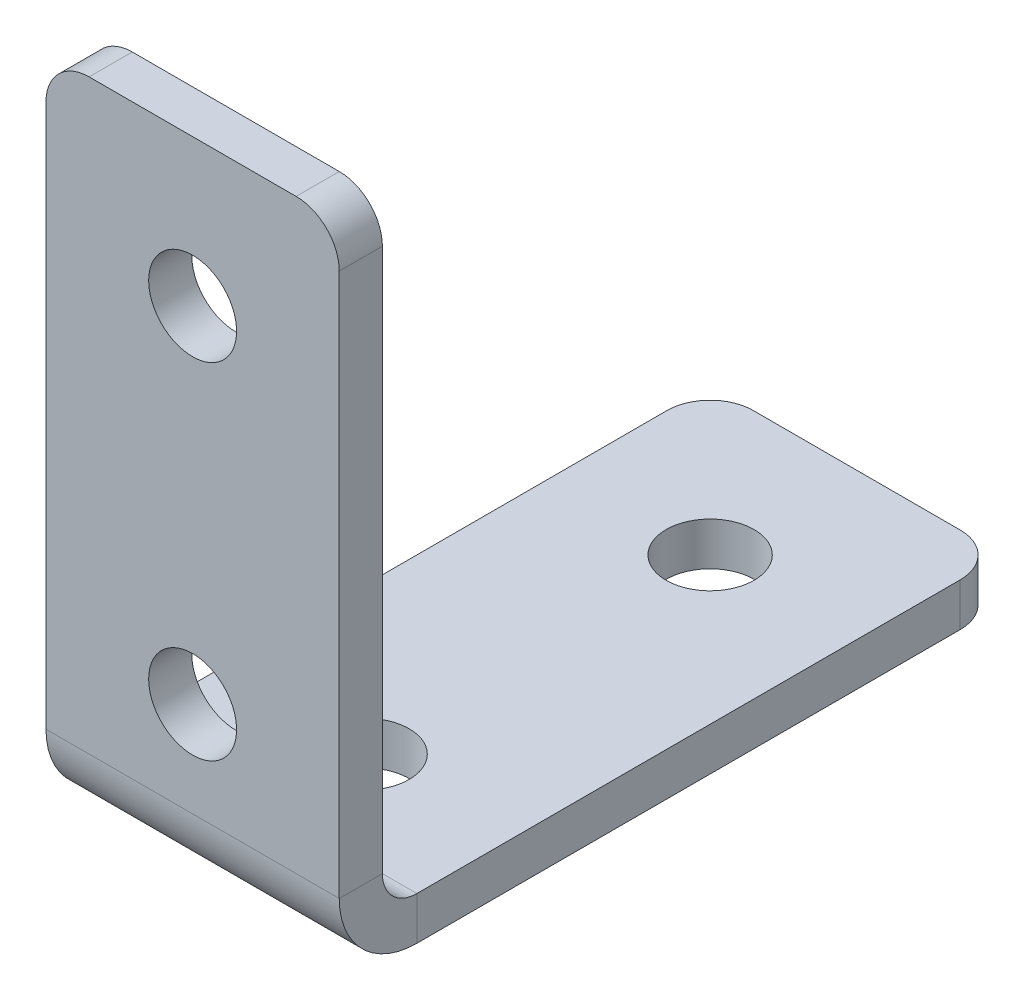
ISO-10303-21;
HEADER;
FILE_DESCRIPTION(('STEP AP214'),'2;1');
FILE_NAME('part.step','',(''),(''),'','','');
FILE_SCHEMA(('AUTOMOTIVE_DESIGN { 1 0 10303 214 1 1 1 1 }'));
ENDSEC;
DATA;
#1=APPLICATION_CONTEXT('core data for automotive mechanical design processes');
#2=APPLICATION_PROTOCOL_DEFINITION('international standard','automotive_design',2000,#1);
#3=PRODUCT_CONTEXT('',#1,'mechanical');
#4=PRODUCT('Part','Part','',(#3));
#5=PRODUCT_RELATED_PRODUCT_CATEGORY('part','',(#4));
#6=PRODUCT_DEFINITION_FORMATION('','',#4);
#7=PRODUCT_DEFINITION_CONTEXT('part definition',#1,'design');
#8=PRODUCT_DEFINITION('design','',#6,#7);
#9=PRODUCT_DEFINITION_SHAPE('','',#8);
#10=(LENGTH_UNIT() NAMED_UNIT(*) SI_UNIT(.MILLI.,.METRE.));
#11=(NAMED_UNIT(*) PLANE_ANGLE_UNIT() SI_UNIT($,.RADIAN.));
#12=(NAMED_UNIT(*) SI_UNIT($,.STERADIAN.) SOLID_ANGLE_UNIT());
#13=UNCERTAINTY_MEASURE_WITH_UNIT(LENGTH_MEASURE(1.E-05),#10,'distance_accuracy_value','');
#14=(GEOMETRIC_REPRESENTATION_CONTEXT(3) GLOBAL_UNCERTAINTY_ASSIGNED_CONTEXT((#13)) GLOBAL_UNIT_ASSIGNED_CONTEXT((#10,
#11,#12)) REPRESENTATION_CONTEXT('',''));
#15=CARTESIAN_POINT('',(0.,0.,0.));
#16=DIRECTION('',(0.,0.,1.));
#17=DIRECTION('',(1.,0.,0.));
#18=AXIS2_PLACEMENT_3D('',#15,#16,#17);
#19=CARTESIAN_POINT('',(14.5,36.,0.));
#20=DIRECTION('',(0.,0.,-1.));
#21=DIRECTION('',(-1.,0.,0.));
#22=AXIS2_PLACEMENT_3D('',#19,#20,#21);
#23=CYLINDRICAL_SURFACE('',#22,2.5);
#24=CARTESIAN_POINT('',(14.5,36.,0.));
#25=DIRECTION('',(0.,0.,-1.));
#26=DIRECTION('',(-1.,0.,0.));
#27=AXIS2_PLACEMENT_3D('',#24,#25,#26);
#28=CIRCLE('',#27,2.5);
#29=CARTESIAN_POINT('',(17.,36.,0.));
#30=VERTEX_POINT('',#29);
#31=CARTESIAN_POINT('',(14.5,38.5,0.));
#32=VERTEX_POINT('',#31);
#33=EDGE_CURVE('E102',#30,#32,#28,.F.);
#34=ORIENTED_EDGE('',*,*,#33,.F.);
#35=DIRECTION('',(0.,0.,-1.));
#36=VECTOR('',#35,1.);
#37=CARTESIAN_POINT('',(17.,36.,-4.5));
#38=LINE('',#37,#36);
#39=CARTESIAN_POINT('',(17.,36.,-2.5));
#40=VERTEX_POINT('',#39);
#41=EDGE_CURVE('E104',#40,#30,#38,.F.);
#42=ORIENTED_EDGE('',*,*,#41,.F.);
#43=CARTESIAN_POINT('',(14.5,36.,-2.5));
#44=DIRECTION('',(0.,0.,-1.));
#45=DIRECTION('',(-1.,0.,0.));
#46=AXIS2_PLACEMENT_3D('',#43,#44,#45);
#47=CIRCLE('',#46,2.5);
#48=CARTESIAN_POINT('',(14.5,38.5,-2.5));
#49=VERTEX_POINT('',#48);
#50=EDGE_CURVE('E119',#49,#40,#47,.T.);
#51=ORIENTED_EDGE('',*,*,#50,.F.);
#52=DIRECTION('',(0.,0.,-1.));
#53=VECTOR('',#52,1.);
#54=CARTESIAN_POINT('',(14.5,38.5,0.));
#55=LINE('',#54,#53);
#56=EDGE_CURVE('E107',#32,#49,#55,.T.);
#57=ORIENTED_EDGE('',*,*,#56,.F.);
#58=EDGE_LOOP('',(#34,#42,#51,#57));
#59=FACE_BOUND('',#58,.T.);
#60=ADVANCED_FACE('F15',(#59),#23,.T.);
#61=CARTESIAN_POINT('',(17.,0.,0.));
#62=DIRECTION('',(0.,0.,-1.));
#63=DIRECTION('',(-1.,0.,0.));
#64=AXIS2_PLACEMENT_3D('',#61,#62,#63);
#65=PLANE('',#64);
#66=CARTESIAN_POINT('',(8.5,30.,0.));
#67=DIRECTION('',(0.,0.,-1.));
#68=DIRECTION('',(-1.,0.,0.));
#69=AXIS2_PLACEMENT_3D('',#66,#67,#68);
#70=CIRCLE('',#69,2.55);
#71=CARTESIAN_POINT('',(5.95,30.,0.));
#72=VERTEX_POINT('',#71);
#73=EDGE_CURVE('E131',#72,#72,#70,.T.);
#74=ORIENTED_EDGE('',*,*,#73,.T.);
#75=EDGE_LOOP('',(#74));
#76=FACE_BOUND('',#75,.T.);
#77=CARTESIAN_POINT('',(8.5,10.,0.));
#78=DIRECTION('',(0.,0.,-1.));
#79=DIRECTION('',(-1.,0.,0.));
#80=AXIS2_PLACEMENT_3D('',#77,#78,#79);
#81=CIRCLE('',#80,2.55);
#82=CARTESIAN_POINT('',(5.95,10.,0.));
#83=VERTEX_POINT('',#82);
#84=EDGE_CURVE('E126',#83,#83,#81,.T.);
#85=ORIENTED_EDGE('',*,*,#84,.T.);
#86=EDGE_LOOP('',(#85));
#87=FACE_BOUND('',#86,.T.);
#88=DIRECTION('',(0.,-1.,0.));
#89=VECTOR('',#88,1.);
#90=CARTESIAN_POINT('',(17.,0.,0.));
#91=LINE('',#90,#89);
#92=CARTESIAN_POINT('',(17.,4.5,0.));
#93=VERTEX_POINT('',#92);
#94=EDGE_CURVE('E116',#30,#93,#91,.T.);
#95=ORIENTED_EDGE('',*,*,#94,.F.);
#96=ORIENTED_EDGE('',*,*,#33,.T.);
#97=DIRECTION('',(-1.,0.,0.));
#98=VECTOR('',#97,1.);
#99=CARTESIAN_POINT('',(17.,38.5,0.));
#100=LINE('',#99,#98);
#101=CARTESIAN_POINT('',(2.5,38.5,0.));
#102=VERTEX_POINT('',#101);
#103=EDGE_CURVE('E125',#32,#102,#100,.T.);
#104=ORIENTED_EDGE('',*,*,#103,.T.);
#105=CARTESIAN_POINT('',(2.5,36.,0.));
#106=DIRECTION('',(0.,0.,-1.));
#107=DIRECTION('',(-1.,0.,0.));
#108=AXIS2_PLACEMENT_3D('',#105,#106,#107);
#109=CIRCLE('',#108,2.5);
#110=CARTESIAN_POINT('',(0.,36.,0.));
#111=VERTEX_POINT('',#110);
#112=EDGE_CURVE('E128',#102,#111,#109,.F.);
#113=ORIENTED_EDGE('',*,*,#112,.T.);
#114=DIRECTION('',(0.,-1.,0.));
#115=VECTOR('',#114,1.);
#116=CARTESIAN_POINT('',(0.,0.,0.));
#117=LINE('',#116,#115);
#118=CARTESIAN_POINT('',(0.,4.5,0.));
#119=VERTEX_POINT('',#118);
#120=EDGE_CURVE('E136',#111,#119,#117,.T.);
#121=ORIENTED_EDGE('',*,*,#120,.T.);
#122=DIRECTION('',(-1.,0.,0.));
#123=VECTOR('',#122,1.);
#124=CARTESIAN_POINT('',(17.,4.5,0.));
#125=LINE('',#124,#123);
#126=EDGE_CURVE('E123',#93,#119,#125,.T.);
#127=ORIENTED_EDGE('',*,*,#126,.F.);
#128=EDGE_LOOP('',(#95,#96,#104,#113,#121,#127));
#129=FACE_BOUND('',#128,.T.);
#130=ADVANCED_FACE('F121',(#76,#87,#129),#65,.F.);
#131=CARTESIAN_POINT('',(8.5,30.,0.));
#132=DIRECTION('',(0.,0.,-1.));
#133=DIRECTION('',(-1.,0.,0.));
#134=AXIS2_PLACEMENT_3D('',#131,#132,#133);
#135=CYLINDRICAL_SURFACE('',#134,2.55);
#136=ORIENTED_EDGE('',*,*,#73,.F.);
#137=EDGE_LOOP('',(#136));
#138=FACE_BOUND('',#137,.T.);
#139=CARTESIAN_POINT('',(8.5,30.,-2.5));
#140=DIRECTION('',(0.,0.,-1.));
#141=DIRECTION('',(-1.,0.,0.));
#142=AXIS2_PLACEMENT_3D('',#139,#140,#141);
#143=CIRCLE('',#142,2.55);
#144=CARTESIAN_POINT('',(5.95,30.,-2.5));
#145=VERTEX_POINT('',#144);
#146=EDGE_CURVE('E139',#145,#145,#143,.T.);
#147=ORIENTED_EDGE('',*,*,#146,.T.);
#148=EDGE_LOOP('',(#147));
#149=FACE_BOUND('',#148,.T.);
#150=ADVANCED_FACE('F305',(#138,#149),#135,.F.);
#151=CARTESIAN_POINT('',(17.,0.,-2.5));
#152=DIRECTION('',(0.,0.,-1.));
#153=DIRECTION('',(-1.,0.,0.));
#154=AXIS2_PLACEMENT_3D('',#151,#152,#153);
#155=PLANE('',#154);
#156=ORIENTED_EDGE('',*,*,#146,.F.);
#157=EDGE_LOOP('',(#156));
#158=FACE_BOUND('',#157,.T.);
#159=CARTESIAN_POINT('',(8.5,10.,-2.5));
#160=DIRECTION('',(0.,0.,-1.));
#161=DIRECTION('',(-1.,0.,0.));
#162=AXIS2_PLACEMENT_3D('',#159,#160,#161);
#163=CIRCLE('',#162,2.55);
#164=CARTESIAN_POINT('',(5.95,10.,-2.5));
#165=VERTEX_POINT('',#164);
#166=EDGE_CURVE('E142',#165,#165,#163,.T.);
#167=ORIENTED_EDGE('',*,*,#166,.F.);
#168=EDGE_LOOP('',(#167));
#169=FACE_BOUND('',#168,.T.);
#170=DIRECTION('',(-1.,0.,0.));
#171=VECTOR('',#170,1.);
#172=CARTESIAN_POINT('',(17.,38.5,-2.5));
#173=LINE('',#172,#171);
#174=CARTESIAN_POINT('',(2.5,38.5,-2.5));
#175=VERTEX_POINT('',#174);
#176=EDGE_CURVE('E145',#49,#175,#173,.T.);
#177=ORIENTED_EDGE('',*,*,#176,.F.);
#178=ORIENTED_EDGE('',*,*,#50,.T.);
#179=DIRECTION('',(0.,1.,0.));
#180=VECTOR('',#179,1.);
#181=CARTESIAN_POINT('',(17.,0.,-2.5));
#182=LINE('',#181,#180);
#183=CARTESIAN_POINT('',(17.,4.5,-2.5));
#184=VERTEX_POINT('',#183);
#185=EDGE_CURVE('E118',#40,#184,#182,.F.);
#186=ORIENTED_EDGE('',*,*,#185,.T.);
#187=DIRECTION('',(-1.,0.,0.));
#188=VECTOR('',#187,1.);
#189=CARTESIAN_POINT('',(17.,4.5,-2.5));
#190=LINE('',#189,#188);
#191=CARTESIAN_POINT('',(0.,4.5,-2.5));
#192=VERTEX_POINT('',#191);
#193=EDGE_CURVE('E148',#184,#192,#190,.T.);
#194=ORIENTED_EDGE('',*,*,#193,.T.);
#195=DIRECTION('',(0.,1.,0.));
#196=VECTOR('',#195,1.);
#197=CARTESIAN_POINT('',(0.,0.,-2.5));
#198=LINE('',#197,#196);
#199=CARTESIAN_POINT('',(0.,36.,-2.5));
#200=VERTEX_POINT('',#199);
#201=EDGE_CURVE('E150',#200,#192,#198,.F.);
#202=ORIENTED_EDGE('',*,*,#201,.F.);
#203=CARTESIAN_POINT('',(2.5,36.,-2.5));
#204=DIRECTION('',(0.,0.,-1.));
#205=DIRECTION('',(-1.,0.,0.));
#206=AXIS2_PLACEMENT_3D('',#203,#204,#205);
#207=CIRCLE('',#206,2.5);
#208=EDGE_CURVE('E153',#200,#175,#207,.T.);
#209=ORIENTED_EDGE('',*,*,#208,.T.);
#210=EDGE_LOOP('',(#177,#178,#186,#194,#202,#209));
#211=FACE_BOUND('',#210,.T.);
#212=ADVANCED_FACE('F291',(#158,#169,#211),#155,.T.);
#213=CARTESIAN_POINT('',(8.5,10.,0.));
#214=DIRECTION('',(0.,0.,-1.));
#215=DIRECTION('',(-1.,0.,0.));
#216=AXIS2_PLACEMENT_3D('',#213,#214,#215);
#217=CYLINDRICAL_SURFACE('',#216,2.55);
#218=ORIENTED_EDGE('',*,*,#84,.F.);
#219=EDGE_LOOP('',(#218));
#220=FACE_BOUND('',#219,.T.);
#221=ORIENTED_EDGE('',*,*,#166,.T.);
#222=EDGE_LOOP('',(#221));
#223=FACE_BOUND('',#222,.T.);
#224=ADVANCED_FACE('F313',(#220,#223),#217,.F.);
#225=CARTESIAN_POINT('',(17.,38.5,0.));
#226=DIRECTION('',(0.,1.,0.));
#227=DIRECTION('',(0.,0.,1.));
#228=AXIS2_PLACEMENT_3D('',#225,#226,#227);
#229=PLANE('',#228);
#230=ORIENTED_EDGE('',*,*,#103,.F.);
#231=ORIENTED_EDGE('',*,*,#56,.T.);
#232=ORIENTED_EDGE('',*,*,#176,.T.);
#233=DIRECTION('',(0.,0.,-1.));
#234=VECTOR('',#233,1.);
#235=CARTESIAN_POINT('',(2.5,38.5,0.));
#236=LINE('',#235,#234);
#237=EDGE_CURVE('E156',#175,#102,#236,.F.);
#238=ORIENTED_EDGE('',*,*,#237,.T.);
#239=EDGE_LOOP('',(#230,#231,#232,#238));
#240=FACE_BOUND('',#239,.T.);
#241=ADVANCED_FACE('F297',(#240),#229,.T.);
#242=CARTESIAN_POINT('',(2.5,36.,-4.5));
#243=DIRECTION('',(0.,0.,1.));
#244=DIRECTION('',(1.,0.,0.));
#245=AXIS2_PLACEMENT_3D('',#242,#243,#244);
#246=CYLINDRICAL_SURFACE('',#245,2.5);
#247=ORIENTED_EDGE('',*,*,#112,.F.);
#248=ORIENTED_EDGE('',*,*,#237,.F.);
#249=ORIENTED_EDGE('',*,*,#208,.F.);
#250=DIRECTION('',(0.,0.,-1.));
#251=VECTOR('',#250,1.);
#252=CARTESIAN_POINT('',(0.,36.,-2.5));
#253=LINE('',#252,#251);
#254=EDGE_CURVE('E159',#111,#200,#253,.T.);
#255=ORIENTED_EDGE('',*,*,#254,.F.);
#256=EDGE_LOOP('',(#247,#248,#249,#255));
#257=FACE_BOUND('',#256,.T.);
#258=ADVANCED_FACE('F295',(#257),#246,.T.);
#259=CARTESIAN_POINT('',(0.,4.5,-4.5));
#260=DIRECTION('',(1.,0.,0.));
#261=DIRECTION('',(0.,0.,-1.));
#262=AXIS2_PLACEMENT_3D('',#259,#260,#261);
#263=PLANE('',#262);
#264=ORIENTED_EDGE('',*,*,#120,.F.);
#265=ORIENTED_EDGE('',*,*,#254,.T.);
#266=ORIENTED_EDGE('',*,*,#201,.T.);
#267=DIRECTION('',(0.,0.,1.));
#268=VECTOR('',#267,1.);
#269=CARTESIAN_POINT('',(0.,4.5,-2.5));
#270=LINE('',#269,#268);
#271=EDGE_CURVE('E162',#192,#119,#270,.T.);
#272=ORIENTED_EDGE('',*,*,#271,.T.);
#273=EDGE_LOOP('',(#264,#265,#266,#272));
#274=FACE_BOUND('',#273,.T.);
#275=ADVANCED_FACE('F286',(#274),#263,.F.);
#276=CARTESIAN_POINT('',(0.,0.,-4.5));
#277=DIRECTION('',(-1.,0.,0.));
#278=DIRECTION('',(0.,0.,1.));
#279=AXIS2_PLACEMENT_3D('',#276,#277,#278);
#280=PLANE('',#279);
#281=DIRECTION('',(0.,1.,0.));
#282=VECTOR('',#281,1.);
#283=CARTESIAN_POINT('',(0.,0.,-4.5));
#284=LINE('',#283,#282);
#285=CARTESIAN_POINT('',(0.,0.,-4.5));
#286=VERTEX_POINT('',#285);
#287=CARTESIAN_POINT('',(0.,2.5,-4.5));
#288=VERTEX_POINT('',#287);
#289=EDGE_CURVE('E165',#286,#288,#284,.T.);
#290=ORIENTED_EDGE('',*,*,#289,.F.);
#291=CARTESIAN_POINT('',(0.,4.5,-4.5));
#292=DIRECTION('',(-1.,0.,0.));
#293=DIRECTION('',(0.,0.,1.));
#294=AXIS2_PLACEMENT_3D('',#291,#292,#293);
#295=CIRCLE('',#294,4.5);
#296=EDGE_CURVE('E167',#119,#286,#295,.F.);
#297=ORIENTED_EDGE('',*,*,#296,.F.);
#298=ORIENTED_EDGE('',*,*,#271,.F.);
#299=CARTESIAN_POINT('',(0.,4.5,-4.5));
#300=DIRECTION('',(1.,0.,0.));
#301=DIRECTION('',(0.,0.,-1.));
#302=AXIS2_PLACEMENT_3D('',#299,#300,#301);
#303=CIRCLE('',#302,2.);
#304=EDGE_CURVE('E170',#192,#288,#303,.T.);
#305=ORIENTED_EDGE('',*,*,#304,.T.);
#306=EDGE_LOOP('',(#290,#297,#298,#305));
#307=FACE_BOUND('',#306,.T.);
#308=ADVANCED_FACE('F283',(#307),#280,.T.);
#309=CARTESIAN_POINT('',(0.,4.5,-2.5));
#310=DIRECTION('',(-1.,0.,0.));
#311=DIRECTION('',(0.,0.,1.));
#312=AXIS2_PLACEMENT_3D('',#309,#310,#311);
#313=PLANE('',#312);
#314=DIRECTION('',(0.,0.,-1.));
#315=VECTOR('',#314,1.);
#316=CARTESIAN_POINT('',(0.,2.5,0.));
#317=LINE('',#316,#315);
#318=CARTESIAN_POINT('',(0.,2.5,-36.));
#319=VERTEX_POINT('',#318);
#320=EDGE_CURVE('E173',#288,#319,#317,.T.);
#321=ORIENTED_EDGE('',*,*,#320,.T.);
#322=DIRECTION('',(0.,-1.,0.));
#323=VECTOR('',#322,1.);
#324=CARTESIAN_POINT('',(0.,4.5,-36.));
#325=LINE('',#324,#323);
#326=CARTESIAN_POINT('',(0.,0.,-36.));
#327=VERTEX_POINT('',#326);
#328=EDGE_CURVE('E175',#319,#327,#325,.T.);
#329=ORIENTED_EDGE('',*,*,#328,.T.);
#330=DIRECTION('',(0.,0.,-1.));
#331=VECTOR('',#330,1.);
#332=CARTESIAN_POINT('',(0.,0.,0.));
#333=LINE('',#332,#331);
#334=EDGE_CURVE('E177',#286,#327,#333,.T.);
#335=ORIENTED_EDGE('',*,*,#334,.F.);
#336=ORIENTED_EDGE('',*,*,#289,.T.);
#337=EDGE_LOOP('',(#321,#329,#335,#336));
#338=FACE_BOUND('',#337,.T.);
#339=ADVANCED_FACE('F257',(#338),#313,.T.);
#340=CARTESIAN_POINT('',(17.,2.5,0.));
#341=DIRECTION('',(0.,1.,0.));
#342=DIRECTION('',(0.,0.,1.));
#343=AXIS2_PLACEMENT_3D('',#340,#341,#342);
#344=PLANE('',#343);
#345=CARTESIAN_POINT('',(8.5,2.5,-30.));
#346=DIRECTION('',(0.,1.,0.));
#347=DIRECTION('',(0.,0.,1.));
#348=AXIS2_PLACEMENT_3D('',#345,#346,#347);
#349=CIRCLE('',#348,2.55);
#350=CARTESIAN_POINT('',(8.5,2.5,-27.45));
#351=VERTEX_POINT('',#350);
#352=EDGE_CURVE('E180',#351,#351,#349,.T.);
#353=ORIENTED_EDGE('',*,*,#352,.F.);
#354=EDGE_LOOP('',(#353));
#355=FACE_BOUND('',#354,.T.);
#356=CARTESIAN_POINT('',(8.5,2.5,-10.));
#357=DIRECTION('',(0.,1.,0.));
#358=DIRECTION('',(0.,0.,1.));
#359=AXIS2_PLACEMENT_3D('',#356,#357,#358);
#360=CIRCLE('',#359,2.55);
#361=CARTESIAN_POINT('',(8.5,2.5,-7.45000000000001));
#362=VERTEX_POINT('',#361);
#363=EDGE_CURVE('E183',#362,#362,#360,.T.);
#364=ORIENTED_EDGE('',*,*,#363,.F.);
#365=EDGE_LOOP('',(#364));
#366=FACE_BOUND('',#365,.T.);
#367=DIRECTION('',(-1.,0.,0.));
#368=VECTOR('',#367,1.);
#369=CARTESIAN_POINT('',(17.,2.5,-38.5));
#370=LINE('',#369,#368);
#371=CARTESIAN_POINT('',(14.5,2.5,-38.5));
#372=VERTEX_POINT('',#371);
#373=CARTESIAN_POINT('',(2.5,2.5,-38.5));
#374=VERTEX_POINT('',#373);
#375=EDGE_CURVE('E186',#372,#374,#370,.T.);
#376=ORIENTED_EDGE('',*,*,#375,.T.);
#377=CARTESIAN_POINT('',(2.5,2.5,-36.));
#378=DIRECTION('',(0.,1.,0.));
#379=DIRECTION('',(0.,0.,1.));
#380=AXIS2_PLACEMENT_3D('',#377,#378,#379);
#381=CIRCLE('',#380,2.5);
#382=EDGE_CURVE('E188',#374,#319,#381,.T.);
#383=ORIENTED_EDGE('',*,*,#382,.T.);
#384=ORIENTED_EDGE('',*,*,#320,.F.);
#385=DIRECTION('',(-1.,0.,0.));
#386=VECTOR('',#385,1.);
#387=CARTESIAN_POINT('',(17.,2.5,-4.5));
#388=LINE('',#387,#386);
#389=CARTESIAN_POINT('',(17.,2.5,-4.5));
#390=VERTEX_POINT('',#389);
#391=EDGE_CURVE('E191',#390,#288,#388,.T.);
#392=ORIENTED_EDGE('',*,*,#391,.F.);
#393=DIRECTION('',(0.,0.,-1.));
#394=VECTOR('',#393,1.);
#395=CARTESIAN_POINT('',(17.,2.5,0.));
#396=LINE('',#395,#394);
#397=CARTESIAN_POINT('',(17.,2.5,-36.));
#398=VERTEX_POINT('',#397);
#399=EDGE_CURVE('E194',#390,#398,#396,.T.);
#400=ORIENTED_EDGE('',*,*,#399,.T.);
#401=CARTESIAN_POINT('',(14.5,2.5,-36.));
#402=DIRECTION('',(0.,1.,0.));
#403=DIRECTION('',(0.,0.,1.));
#404=AXIS2_PLACEMENT_3D('',#401,#402,#403);
#405=CIRCLE('',#404,2.5);
#406=EDGE_CURVE('E196',#398,#372,#405,.T.);
#407=ORIENTED_EDGE('',*,*,#406,.T.);
#408=EDGE_LOOP('',(#376,#383,#384,#392,#400,#407));
#409=FACE_BOUND('',#408,.T.);
#410=ADVANCED_FACE('F243',(#355,#366,#409),#344,.T.);
#411=CARTESIAN_POINT('',(8.5,0.,-30.));
#412=DIRECTION('',(0.,1.,0.));
#413=DIRECTION('',(0.,0.,1.));
#414=AXIS2_PLACEMENT_3D('',#411,#412,#413);
#415=CYLINDRICAL_SURFACE('',#414,2.55);
#416=CARTESIAN_POINT('',(8.5,0.,-30.));
#417=DIRECTION('',(0.,1.,0.));
#418=DIRECTION('',(0.,0.,1.));
#419=AXIS2_PLACEMENT_3D('',#416,#417,#418);
#420=CIRCLE('',#419,2.55);
#421=CARTESIAN_POINT('',(8.5,0.,-27.45));
#422=VERTEX_POINT('',#421);
#423=EDGE_CURVE('E199',#422,#422,#420,.T.);
#424=ORIENTED_EDGE('',*,*,#423,.F.);
#425=EDGE_LOOP('',(#424));
#426=FACE_BOUND('',#425,.T.);
#427=ORIENTED_EDGE('',*,*,#352,.T.);
#428=EDGE_LOOP('',(#427));
#429=FACE_BOUND('',#428,.T.);
#430=ADVANCED_FACE('F261',(#426,#429),#415,.F.);
#431=CARTESIAN_POINT('',(17.,0.,0.));
#432=DIRECTION('',(0.,1.,0.));
#433=DIRECTION('',(0.,0.,1.));
#434=AXIS2_PLACEMENT_3D('',#431,#432,#433);
#435=PLANE('',#434);
#436=ORIENTED_EDGE('',*,*,#423,.T.);
#437=EDGE_LOOP('',(#436));
#438=FACE_BOUND('',#437,.T.);
#439=CARTESIAN_POINT('',(8.5,0.,-10.));
#440=DIRECTION('',(0.,1.,0.));
#441=DIRECTION('',(0.,0.,1.));
#442=AXIS2_PLACEMENT_3D('',#439,#440,#441);
#443=CIRCLE('',#442,2.55);
#444=CARTESIAN_POINT('',(8.5,0.,-7.45000000000001));
#445=VERTEX_POINT('',#444);
#446=EDGE_CURVE('E202',#445,#445,#443,.T.);
#447=ORIENTED_EDGE('',*,*,#446,.T.);
#448=EDGE_LOOP('',(#447));
#449=FACE_BOUND('',#448,.T.);
#450=ORIENTED_EDGE('',*,*,#334,.T.);
#451=CARTESIAN_POINT('',(2.5,0.,-36.));
#452=DIRECTION('',(0.,1.,0.));
#453=DIRECTION('',(0.,0.,1.));
#454=AXIS2_PLACEMENT_3D('',#451,#452,#453);
#455=CIRCLE('',#454,2.5);
#456=CARTESIAN_POINT('',(2.5,0.,-38.5));
#457=VERTEX_POINT('',#456);
#458=EDGE_CURVE('E205',#327,#457,#455,.F.);
#459=ORIENTED_EDGE('',*,*,#458,.T.);
#460=DIRECTION('',(-1.,0.,0.));
#461=VECTOR('',#460,1.);
#462=CARTESIAN_POINT('',(17.,0.,-38.5));
#463=LINE('',#462,#461);
#464=CARTESIAN_POINT('',(14.5,0.,-38.5));
#465=VERTEX_POINT('',#464);
#466=EDGE_CURVE('E207',#465,#457,#463,.T.);
#467=ORIENTED_EDGE('',*,*,#466,.F.);
#468=CARTESIAN_POINT('',(14.5,0.,-36.));
#469=DIRECTION('',(0.,1.,0.));
#470=DIRECTION('',(0.,0.,1.));
#471=AXIS2_PLACEMENT_3D('',#468,#469,#470);
#472=CIRCLE('',#471,2.5);
#473=CARTESIAN_POINT('',(17.,0.,-36.));
#474=VERTEX_POINT('',#473);
#475=EDGE_CURVE('E35',#465,#474,#472,.F.);
#476=ORIENTED_EDGE('',*,*,#475,.T.);
#477=DIRECTION('',(0.,0.,-1.));
#478=VECTOR('',#477,1.);
#479=CARTESIAN_POINT('',(17.,0.,0.));
#480=LINE('',#479,#478);
#481=CARTESIAN_POINT('',(17.,0.,-4.5));
#482=VERTEX_POINT('',#481);
#483=EDGE_CURVE('E30',#482,#474,#480,.T.);
#484=ORIENTED_EDGE('',*,*,#483,.F.);
#485=DIRECTION('',(-1.,0.,0.));
#486=VECTOR('',#485,1.);
#487=CARTESIAN_POINT('',(17.,0.,-4.5));
#488=LINE('',#487,#486);
#489=EDGE_CURVE('E212',#482,#286,#488,.T.);
#490=ORIENTED_EDGE('',*,*,#489,.T.);
#491=EDGE_LOOP('',(#450,#459,#467,#476,#484,#490));
#492=FACE_BOUND('',#491,.T.);
#493=ADVANCED_FACE('F258',(#438,#449,#492),#435,.F.);
#494=CARTESIAN_POINT('',(8.5,0.,-10.));
#495=DIRECTION('',(0.,1.,0.));
#496=DIRECTION('',(0.,0.,1.));
#497=AXIS2_PLACEMENT_3D('',#494,#495,#496);
#498=CYLINDRICAL_SURFACE('',#497,2.55);
#499=ORIENTED_EDGE('',*,*,#446,.F.);
#500=EDGE_LOOP('',(#499));
#501=FACE_BOUND('',#500,.T.);
#502=ORIENTED_EDGE('',*,*,#363,.T.);
#503=EDGE_LOOP('',(#502));
#504=FACE_BOUND('',#503,.T.);
#505=ADVANCED_FACE('F260',(#501,#504),#498,.F.);
#506=CARTESIAN_POINT('',(2.5,4.5,-36.));
#507=DIRECTION('',(0.,-1.,0.));
#508=DIRECTION('',(0.,0.,-1.));
#509=AXIS2_PLACEMENT_3D('',#506,#507,#508);
#510=CYLINDRICAL_SURFACE('',#509,2.5);
#511=ORIENTED_EDGE('',*,*,#382,.F.);
#512=DIRECTION('',(0.,-1.,0.));
#513=VECTOR('',#512,1.);
#514=CARTESIAN_POINT('',(2.5,2.5,-38.5));
#515=LINE('',#514,#513);
#516=EDGE_CURVE('E214',#457,#374,#515,.F.);
#517=ORIENTED_EDGE('',*,*,#516,.F.);
#518=ORIENTED_EDGE('',*,*,#458,.F.);
#519=ORIENTED_EDGE('',*,*,#328,.F.);
#520=EDGE_LOOP('',(#511,#517,#518,#519));
#521=FACE_BOUND('',#520,.T.);
#522=ADVANCED_FACE('F254',(#521),#510,.T.);
#523=CARTESIAN_POINT('',(17.,2.5,-38.5));
#524=DIRECTION('',(0.,0.,-1.));
#525=DIRECTION('',(-1.,0.,0.));
#526=AXIS2_PLACEMENT_3D('',#523,#524,#525);
#527=PLANE('',#526);
#528=ORIENTED_EDGE('',*,*,#466,.T.);
#529=ORIENTED_EDGE('',*,*,#516,.T.);
#530=ORIENTED_EDGE('',*,*,#375,.F.);
#531=DIRECTION('',(0.,-1.,0.));
#532=VECTOR('',#531,1.);
#533=CARTESIAN_POINT('',(14.5,2.5,-38.5));
#534=LINE('',#533,#532);
#535=EDGE_CURVE('E217',#372,#465,#534,.T.);
#536=ORIENTED_EDGE('',*,*,#535,.T.);
#537=EDGE_LOOP('',(#528,#529,#530,#536));
#538=FACE_BOUND('',#537,.T.);
#539=ADVANCED_FACE('F249',(#538),#527,.T.);
#540=CARTESIAN_POINT('',(14.5,2.5,-36.));
#541=DIRECTION('',(0.,-1.,0.));
#542=DIRECTION('',(0.,0.,-1.));
#543=AXIS2_PLACEMENT_3D('',#540,#541,#542);
#544=CYLINDRICAL_SURFACE('',#543,2.5);
#545=ORIENTED_EDGE('',*,*,#406,.F.);
#546=DIRECTION('',(0.,-1.,0.));
#547=VECTOR('',#546,1.);
#548=CARTESIAN_POINT('',(17.,4.5,-36.));
#549=LINE('',#548,#547);
#550=EDGE_CURVE('E220',#474,#398,#549,.F.);
#551=ORIENTED_EDGE('',*,*,#550,.F.);
#552=ORIENTED_EDGE('',*,*,#475,.F.);
#553=ORIENTED_EDGE('',*,*,#535,.F.);
#554=EDGE_LOOP('',(#545,#551,#552,#553));
#555=FACE_BOUND('',#554,.T.);
#556=ADVANCED_FACE('F247',(#555),#544,.T.);
#557=CARTESIAN_POINT('',(17.,4.5,-4.5));
#558=DIRECTION('',(1.,0.,0.));
#559=DIRECTION('',(0.,0.,-1.));
#560=AXIS2_PLACEMENT_3D('',#557,#558,#559);
#561=PLANE('',#560);
#562=ORIENTED_EDGE('',*,*,#483,.T.);
#563=ORIENTED_EDGE('',*,*,#550,.T.);
#564=ORIENTED_EDGE('',*,*,#399,.F.);
#565=DIRECTION('',(0.,-1.,0.));
#566=VECTOR('',#565,1.);
#567=CARTESIAN_POINT('',(17.,2.5,-4.5));
#568=LINE('',#567,#566);
#569=EDGE_CURVE('E223',#390,#482,#568,.T.);
#570=ORIENTED_EDGE('',*,*,#569,.T.);
#571=EDGE_LOOP('',(#562,#563,#564,#570));
#572=FACE_BOUND('',#571,.T.);
#573=ADVANCED_FACE('F239',(#572),#561,.T.);
#574=CARTESIAN_POINT('',(17.,4.5,0.));
#575=DIRECTION('',(1.,0.,0.));
#576=DIRECTION('',(0.,0.,-1.));
#577=AXIS2_PLACEMENT_3D('',#574,#575,#576);
#578=PLANE('',#577);
#579=DIRECTION('',(0.,0.,-1.));
#580=VECTOR('',#579,1.);
#581=CARTESIAN_POINT('',(17.,4.5,0.));
#582=LINE('',#581,#580);
#583=EDGE_CURVE('E226',#93,#184,#582,.T.);
#584=ORIENTED_EDGE('',*,*,#583,.F.);
#585=CARTESIAN_POINT('',(17.,4.5,-4.5));
#586=DIRECTION('',(-1.,0.,0.));
#587=DIRECTION('',(0.,0.,1.));
#588=AXIS2_PLACEMENT_3D('',#585,#586,#587);
#589=CIRCLE('',#588,4.5);
#590=EDGE_CURVE('E23',#93,#482,#589,.F.);
#591=ORIENTED_EDGE('',*,*,#590,.T.);
#592=ORIENTED_EDGE('',*,*,#569,.F.);
#593=CARTESIAN_POINT('',(17.,4.5,-4.5));
#594=DIRECTION('',(1.,0.,0.));
#595=DIRECTION('',(0.,0.,-1.));
#596=AXIS2_PLACEMENT_3D('',#593,#594,#595);
#597=CIRCLE('',#596,2.);
#598=EDGE_CURVE('E10',#184,#390,#597,.T.);
#599=ORIENTED_EDGE('',*,*,#598,.F.);
#600=EDGE_LOOP('',(#584,#591,#592,#599));
#601=FACE_BOUND('',#600,.T.);
#602=ADVANCED_FACE('F231',(#601),#578,.T.);
#603=CARTESIAN_POINT('',(17.,2.5,-4.5));
#604=DIRECTION('',(1.,0.,0.));
#605=DIRECTION('',(0.,0.,-1.));
#606=AXIS2_PLACEMENT_3D('',#603,#604,#605);
#607=PLANE('',#606);
#608=ORIENTED_EDGE('',*,*,#185,.F.);
#609=ORIENTED_EDGE('',*,*,#41,.T.);
#610=ORIENTED_EDGE('',*,*,#94,.T.);
#611=ORIENTED_EDGE('',*,*,#583,.T.);
#612=EDGE_LOOP('',(#608,#609,#610,#611));
#613=FACE_BOUND('',#612,.T.);
#614=ADVANCED_FACE('F114',(#613),#607,.T.);
#615=CARTESIAN_POINT('',(17.,4.5,-4.5));
#616=DIRECTION('',(-1.,0.,0.));
#617=DIRECTION('',(0.,0.,1.));
#618=AXIS2_PLACEMENT_3D('',#615,#616,#617);
#619=CYLINDRICAL_SURFACE('',#618,4.5);
#620=ORIENTED_EDGE('',*,*,#296,.T.);
#621=ORIENTED_EDGE('',*,*,#489,.F.);
#622=ORIENTED_EDGE('',*,*,#590,.F.);
#623=ORIENTED_EDGE('',*,*,#126,.T.);
#624=EDGE_LOOP('',(#620,#621,#622,#623));
#625=FACE_BOUND('',#624,.T.);
#626=ADVANCED_FACE('F234',(#625),#619,.T.);
#627=CARTESIAN_POINT('',(17.,4.5,-4.5));
#628=DIRECTION('',(-1.,0.,0.));
#629=DIRECTION('',(0.,0.,1.));
#630=AXIS2_PLACEMENT_3D('',#627,#628,#629);
#631=CYLINDRICAL_SURFACE('',#630,2.);
#632=ORIENTED_EDGE('',*,*,#304,.F.);
#633=ORIENTED_EDGE('',*,*,#193,.F.);
#634=ORIENTED_EDGE('',*,*,#598,.T.);
#635=ORIENTED_EDGE('',*,*,#391,.T.);
#636=EDGE_LOOP('',(#632,#633,#634,#635));
#637=FACE_BOUND('',#636,.T.);
#638=ADVANCED_FACE('F17',(#637),#631,.F.);
#639=CLOSED_SHELL('',(#60,#130,#150,#212,#224,#241,#258,#275,#308,#339,#410,#430,#493,#505,#522,
#539,#556,#573,#602,#614,#626,#638));
#640=MANIFOLD_SOLID_BREP('B1',#639);
#641=ADVANCED_BREP_SHAPE_REPRESENTATION('',(#18,#640),#14);
#642=SHAPE_DEFINITION_REPRESENTATION(#9,#641);
ENDSEC;
END-ISO-10303-21;
